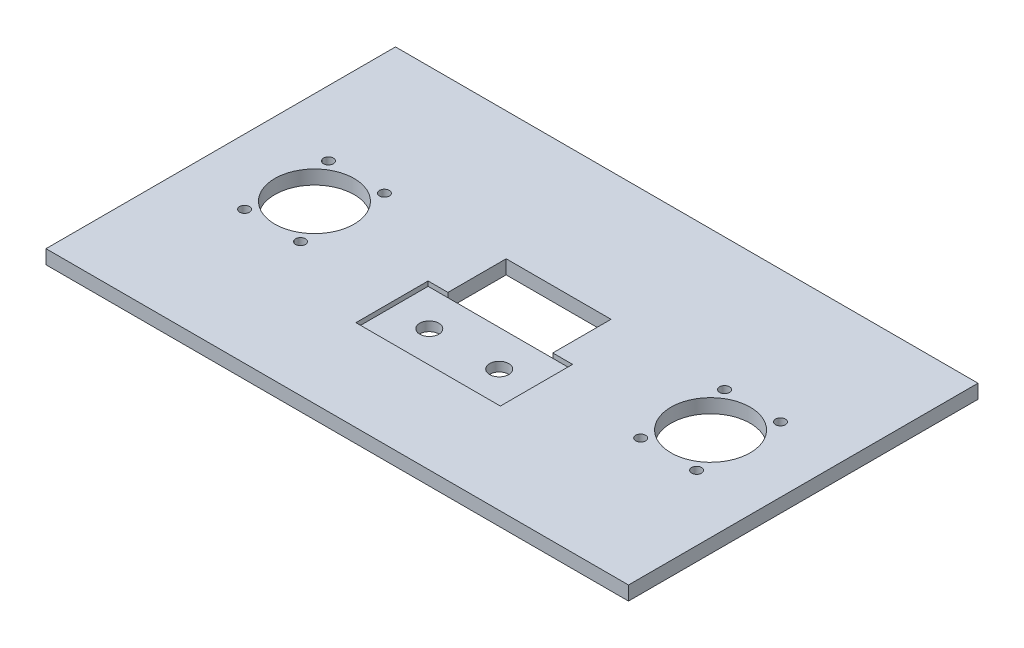
ISO-10303-21;
HEADER;
FILE_DESCRIPTION(('STEP AP214'),'2;1');
FILE_NAME('part.step','',(''),(''),'','','');
FILE_SCHEMA(('AUTOMOTIVE_DESIGN { 1 0 10303 214 1 1 1 1 }'));
ENDSEC;
DATA;
#1=APPLICATION_CONTEXT('core data for automotive mechanical design processes');
#2=APPLICATION_PROTOCOL_DEFINITION('international standard','automotive_design',2000,#1);
#3=PRODUCT_CONTEXT('',#1,'mechanical');
#4=PRODUCT('Part','Part','',(#3));
#5=PRODUCT_RELATED_PRODUCT_CATEGORY('part','',(#4));
#6=PRODUCT_DEFINITION_FORMATION('','',#4);
#7=PRODUCT_DEFINITION_CONTEXT('part definition',#1,'design');
#8=PRODUCT_DEFINITION('design','',#6,#7);
#9=PRODUCT_DEFINITION_SHAPE('','',#8);
#10=(LENGTH_UNIT() NAMED_UNIT(*) SI_UNIT(.MILLI.,.METRE.));
#11=(NAMED_UNIT(*) PLANE_ANGLE_UNIT() SI_UNIT($,.RADIAN.));
#12=(NAMED_UNIT(*) SI_UNIT($,.STERADIAN.) SOLID_ANGLE_UNIT());
#13=UNCERTAINTY_MEASURE_WITH_UNIT(LENGTH_MEASURE(1.E-05),#10,'distance_accuracy_value','');
#14=(GEOMETRIC_REPRESENTATION_CONTEXT(3) GLOBAL_UNCERTAINTY_ASSIGNED_CONTEXT((#13)) GLOBAL_UNIT_ASSIGNED_CONTEXT((#10,
#11,#12)) REPRESENTATION_CONTEXT('',''));
#15=CARTESIAN_POINT('',(0.,0.,0.));
#16=DIRECTION('',(0.,0.,1.));
#17=DIRECTION('',(1.,0.,0.));
#18=AXIS2_PLACEMENT_3D('',#15,#16,#17);
#19=CARTESIAN_POINT('',(0.,6.,0.));
#20=DIRECTION('',(0.,1.,0.));
#21=DIRECTION('',(0.,0.,1.));
#22=AXIS2_PLACEMENT_3D('',#19,#20,#21);
#23=PLANE('',#22);
#24=CARTESIAN_POINT('',(-97.,6.,17.7776119620314));
#25=DIRECTION('',(0.,-1.,0.));
#26=DIRECTION('',(0.,0.,-1.));
#27=AXIS2_PLACEMENT_3D('',#24,#25,#26);
#28=CIRCLE('',#27,2.125);
#29=CARTESIAN_POINT('',(-97.,6.,15.6526119620314));
#30=VERTEX_POINT('',#29);
#31=EDGE_CURVE('E725',#30,#30,#28,.T.);
#32=ORIENTED_EDGE('',*,*,#31,.T.);
#33=EDGE_LOOP('',(#32));
#34=FACE_BOUND('',#33,.T.);
#35=CARTESIAN_POINT('',(-85.,6.,-0.222388037968629));
#36=DIRECTION('',(0.,1.,0.));
#37=DIRECTION('',(0.,0.,1.));
#38=AXIS2_PLACEMENT_3D('',#35,#36,#37);
#39=CIRCLE('',#38,17.);
#40=CARTESIAN_POINT('',(-85.,6.,16.7776119620314));
#41=VERTEX_POINT('',#40);
#42=EDGE_CURVE('E205',#41,#41,#39,.T.);
#43=ORIENTED_EDGE('',*,*,#42,.F.);
#44=EDGE_LOOP('',(#43));
#45=FACE_BOUND('',#44,.T.);
#46=CARTESIAN_POINT('',(85.,6.,-0.222388037968653));
#47=DIRECTION('',(0.,1.,0.));
#48=DIRECTION('',(0.,0.,1.));
#49=AXIS2_PLACEMENT_3D('',#46,#47,#48);
#50=CIRCLE('',#49,17.);
#51=CARTESIAN_POINT('',(85.,6.,16.7776119620314));
#52=VERTEX_POINT('',#51);
#53=EDGE_CURVE('E741',#52,#52,#50,.T.);
#54=ORIENTED_EDGE('',*,*,#53,.F.);
#55=EDGE_LOOP('',(#54));
#56=FACE_BOUND('',#55,.T.);
#57=CARTESIAN_POINT('',(97.,6.,-18.2223880379686));
#58=DIRECTION('',(0.,-1.,0.));
#59=DIRECTION('',(0.,0.,-1.));
#60=AXIS2_PLACEMENT_3D('',#57,#58,#59);
#61=CIRCLE('',#60,2.125);
#62=CARTESIAN_POINT('',(97.,6.,-20.3473880379686));
#63=VERTEX_POINT('',#62);
#64=EDGE_CURVE('E715',#63,#63,#61,.T.);
#65=ORIENTED_EDGE('',*,*,#64,.T.);
#66=EDGE_LOOP('',(#65));
#67=FACE_BOUND('',#66,.T.);
#68=DIRECTION('',(0.,0.,-1.));
#69=VECTOR('',#68,1.);
#70=CARTESIAN_POINT('',(-125.,6.,0.));
#71=LINE('',#70,#69);
#72=CARTESIAN_POINT('',(-125.,6.,75.));
#73=VERTEX_POINT('',#72);
#74=CARTESIAN_POINT('',(-125.,6.,-75.));
#75=VERTEX_POINT('',#74);
#76=EDGE_CURVE('E293',#73,#75,#71,.T.);
#77=ORIENTED_EDGE('',*,*,#76,.F.);
#78=DIRECTION('',(1.,0.,0.));
#79=VECTOR('',#78,1.);
#80=CARTESIAN_POINT('',(0.,6.,75.));
#81=LINE('',#80,#79);
#82=CARTESIAN_POINT('',(125.,6.,75.));
#83=VERTEX_POINT('',#82);
#84=EDGE_CURVE('E297',#73,#83,#81,.T.);
#85=ORIENTED_EDGE('',*,*,#84,.T.);
#86=DIRECTION('',(0.,0.,-1.));
#87=VECTOR('',#86,1.);
#88=CARTESIAN_POINT('',(125.,6.,0.));
#89=LINE('',#88,#87);
#90=CARTESIAN_POINT('',(125.,6.,-75.));
#91=VERTEX_POINT('',#90);
#92=EDGE_CURVE('E301',#83,#91,#89,.T.);
#93=ORIENTED_EDGE('',*,*,#92,.T.);
#94=DIRECTION('',(1.,0.,0.));
#95=VECTOR('',#94,1.);
#96=CARTESIAN_POINT('',(0.,6.,-75.));
#97=LINE('',#96,#95);
#98=EDGE_CURVE('E304',#75,#91,#97,.T.);
#99=ORIENTED_EDGE('',*,*,#98,.F.);
#100=EDGE_LOOP('',(#77,#85,#93,#99));
#101=FACE_BOUND('',#100,.T.);
#102=DIRECTION('',(1.,0.,0.));
#103=VECTOR('',#102,1.);
#104=CARTESIAN_POINT('',(0.,6.,-20.));
#105=LINE('',#104,#103);
#106=CARTESIAN_POINT('',(-22.5,6.,-20.));
#107=VERTEX_POINT('',#106);
#108=CARTESIAN_POINT('',(22.5,6.,-20.));
#109=VERTEX_POINT('',#108);
#110=EDGE_CURVE('E188',#107,#109,#105,.T.);
#111=ORIENTED_EDGE('',*,*,#110,.T.);
#112=DIRECTION('',(0.,0.,1.));
#113=VECTOR('',#112,1.);
#114=CARTESIAN_POINT('',(22.5,6.,0.));
#115=LINE('',#114,#113);
#116=CARTESIAN_POINT('',(22.5,6.,4.99999999999999));
#117=VERTEX_POINT('',#116);
#118=EDGE_CURVE('E197',#109,#117,#115,.T.);
#119=ORIENTED_EDGE('',*,*,#118,.T.);
#120=DIRECTION('',(1.,0.,0.));
#121=VECTOR('',#120,1.);
#122=CARTESIAN_POINT('',(0.,6.,4.99999999999999));
#123=LINE('',#122,#121);
#124=CARTESIAN_POINT('',(31.,6.,4.99999999999999));
#125=VERTEX_POINT('',#124);
#126=EDGE_CURVE('E271',#117,#125,#123,.T.);
#127=ORIENTED_EDGE('',*,*,#126,.T.);
#128=DIRECTION('',(0.,0.,-1.));
#129=VECTOR('',#128,1.);
#130=CARTESIAN_POINT('',(31.,6.,0.));
#131=LINE('',#130,#129);
#132=CARTESIAN_POINT('',(31.,6.,36.));
#133=VERTEX_POINT('',#132);
#134=EDGE_CURVE('E267',#133,#125,#131,.T.);
#135=ORIENTED_EDGE('',*,*,#134,.F.);
#136=DIRECTION('',(1.,0.,0.));
#137=VECTOR('',#136,1.);
#138=CARTESIAN_POINT('',(0.,6.,36.));
#139=LINE('',#138,#137);
#140=CARTESIAN_POINT('',(-31.,6.,36.));
#141=VERTEX_POINT('',#140);
#142=EDGE_CURVE('E264',#141,#133,#139,.T.);
#143=ORIENTED_EDGE('',*,*,#142,.F.);
#144=DIRECTION('',(0.,0.,-1.));
#145=VECTOR('',#144,1.);
#146=CARTESIAN_POINT('',(-31.,6.,0.));
#147=LINE('',#146,#145);
#148=CARTESIAN_POINT('',(-31.,6.,4.99999999999999));
#149=VERTEX_POINT('',#148);
#150=EDGE_CURVE('E241',#141,#149,#147,.T.);
#151=ORIENTED_EDGE('',*,*,#150,.T.);
#152=CARTESIAN_POINT('',(-22.5,6.,4.99999999999999));
#153=VERTEX_POINT('',#152);
#154=EDGE_CURVE('E272',#149,#153,#123,.T.);
#155=ORIENTED_EDGE('',*,*,#154,.T.);
#156=DIRECTION('',(0.,0.,1.));
#157=VECTOR('',#156,1.);
#158=CARTESIAN_POINT('',(-22.5,6.,0.));
#159=LINE('',#158,#157);
#160=EDGE_CURVE('E194',#107,#153,#159,.T.);
#161=ORIENTED_EDGE('',*,*,#160,.F.);
#162=EDGE_LOOP('',(#111,#119,#127,#135,#143,#151,#155,#161));
#163=FACE_BOUND('',#162,.T.);
#164=CARTESIAN_POINT('',(97.,6.,17.7776119620314));
#165=DIRECTION('',(0.,1.,0.));
#166=DIRECTION('',(0.,0.,1.));
#167=AXIS2_PLACEMENT_3D('',#164,#165,#166);
#168=CIRCLE('',#167,2.125);
#169=CARTESIAN_POINT('',(97.,6.,19.9026119620314));
#170=VERTEX_POINT('',#169);
#171=EDGE_CURVE('E701',#170,#170,#168,.T.);
#172=ORIENTED_EDGE('',*,*,#171,.F.);
#173=EDGE_LOOP('',(#172));
#174=FACE_BOUND('',#173,.T.);
#175=CARTESIAN_POINT('',(-97.,6.,-18.2223880379686));
#176=DIRECTION('',(0.,1.,0.));
#177=DIRECTION('',(0.,0.,1.));
#178=AXIS2_PLACEMENT_3D('',#175,#176,#177);
#179=CIRCLE('',#178,2.125);
#180=CARTESIAN_POINT('',(-97.,6.,-16.0973880379686));
#181=VERTEX_POINT('',#180);
#182=EDGE_CURVE('E729',#181,#181,#179,.T.);
#183=ORIENTED_EDGE('',*,*,#182,.F.);
#184=EDGE_LOOP('',(#183));
#185=FACE_BOUND('',#184,.T.);
#186=CARTESIAN_POINT('',(-73.,6.,-18.2223880379686));
#187=DIRECTION('',(0.,-1.,0.));
#188=DIRECTION('',(0.,0.,-1.));
#189=AXIS2_PLACEMENT_3D('',#186,#187,#188);
#190=CIRCLE('',#189,2.125);
#191=CARTESIAN_POINT('',(-73.,6.,-20.3473880379686));
#192=VERTEX_POINT('',#191);
#193=EDGE_CURVE('E737',#192,#192,#190,.T.);
#194=ORIENTED_EDGE('',*,*,#193,.T.);
#195=EDGE_LOOP('',(#194));
#196=FACE_BOUND('',#195,.T.);
#197=CARTESIAN_POINT('',(-73.,6.,17.7776119620314));
#198=DIRECTION('',(0.,1.,0.));
#199=DIRECTION('',(0.,0.,1.));
#200=AXIS2_PLACEMENT_3D('',#197,#198,#199);
#201=CIRCLE('',#200,2.125);
#202=CARTESIAN_POINT('',(-73.,6.,19.9026119620314));
#203=VERTEX_POINT('',#202);
#204=EDGE_CURVE('E730',#203,#203,#201,.T.);
#205=ORIENTED_EDGE('',*,*,#204,.F.);
#206=EDGE_LOOP('',(#205));
#207=FACE_BOUND('',#206,.T.);
#208=CARTESIAN_POINT('',(73.,6.,-18.2223880379686));
#209=DIRECTION('',(0.,1.,0.));
#210=DIRECTION('',(0.,0.,1.));
#211=AXIS2_PLACEMENT_3D('',#208,#209,#210);
#212=CIRCLE('',#211,2.125);
#213=CARTESIAN_POINT('',(73.,6.,-16.0973880379686));
#214=VERTEX_POINT('',#213);
#215=EDGE_CURVE('E720',#214,#214,#212,.T.);
#216=ORIENTED_EDGE('',*,*,#215,.F.);
#217=EDGE_LOOP('',(#216));
#218=FACE_BOUND('',#217,.T.);
#219=CARTESIAN_POINT('',(73.,6.,17.7776119620314));
#220=DIRECTION('',(0.,-1.,0.));
#221=DIRECTION('',(0.,0.,-1.));
#222=AXIS2_PLACEMENT_3D('',#219,#220,#221);
#223=CIRCLE('',#222,2.125);
#224=CARTESIAN_POINT('',(73.,6.,15.6526119620314));
#225=VERTEX_POINT('',#224);
#226=EDGE_CURVE('E714',#225,#225,#223,.T.);
#227=ORIENTED_EDGE('',*,*,#226,.T.);
#228=EDGE_LOOP('',(#227));
#229=FACE_BOUND('',#228,.T.);
#230=ADVANCED_FACE('F89',(#34,#45,#56,#67,#101,#163,#174,#185,#196,#207,#218,#229),#23,.T.);
#231=CARTESIAN_POINT('',(0.,0.,0.));
#232=DIRECTION('',(0.,1.,0.));
#233=DIRECTION('',(0.,0.,1.));
#234=AXIS2_PLACEMENT_3D('',#231,#232,#233);
#235=PLANE('',#234);
#236=CARTESIAN_POINT('',(73.,0.,-18.2223880379686));
#237=DIRECTION('',(0.,1.,0.));
#238=DIRECTION('',(0.,0.,1.));
#239=AXIS2_PLACEMENT_3D('',#236,#237,#238);
#240=CIRCLE('',#239,2.125);
#241=CARTESIAN_POINT('',(73.,0.,-16.0973880379686));
#242=VERTEX_POINT('',#241);
#243=EDGE_CURVE('E371',#242,#242,#240,.T.);
#244=ORIENTED_EDGE('',*,*,#243,.T.);
#245=EDGE_LOOP('',(#244));
#246=FACE_BOUND('',#245,.T.);
#247=CARTESIAN_POINT('',(-73.,0.,17.7776119620314));
#248=DIRECTION('',(0.,1.,0.));
#249=DIRECTION('',(0.,0.,1.));
#250=AXIS2_PLACEMENT_3D('',#247,#248,#249);
#251=CIRCLE('',#250,2.125);
#252=CARTESIAN_POINT('',(-73.,0.,19.9026119620314));
#253=VERTEX_POINT('',#252);
#254=EDGE_CURVE('E368',#253,#253,#251,.T.);
#255=ORIENTED_EDGE('',*,*,#254,.T.);
#256=EDGE_LOOP('',(#255));
#257=FACE_BOUND('',#256,.T.);
#258=CARTESIAN_POINT('',(-85.,0.,-0.222388037968629));
#259=DIRECTION('',(0.,1.,0.));
#260=DIRECTION('',(0.,0.,1.));
#261=AXIS2_PLACEMENT_3D('',#258,#259,#260);
#262=CIRCLE('',#261,17.);
#263=CARTESIAN_POINT('',(-85.,0.,16.7776119620314));
#264=VERTEX_POINT('',#263);
#265=EDGE_CURVE('E360',#264,#264,#262,.T.);
#266=ORIENTED_EDGE('',*,*,#265,.T.);
#267=EDGE_LOOP('',(#266));
#268=FACE_BOUND('',#267,.T.);
#269=CARTESIAN_POINT('',(85.,0.,-0.222388037968653));
#270=DIRECTION('',(0.,1.,0.));
#271=DIRECTION('',(0.,0.,1.));
#272=AXIS2_PLACEMENT_3D('',#269,#270,#271);
#273=CIRCLE('',#272,17.);
#274=CARTESIAN_POINT('',(85.,0.,16.7776119620314));
#275=VERTEX_POINT('',#274);
#276=EDGE_CURVE('E356',#275,#275,#273,.T.);
#277=ORIENTED_EDGE('',*,*,#276,.T.);
#278=EDGE_LOOP('',(#277));
#279=FACE_BOUND('',#278,.T.);
#280=CARTESIAN_POINT('',(-97.,0.,-18.2223880379686));
#281=DIRECTION('',(0.,1.,0.));
#282=DIRECTION('',(0.,0.,1.));
#283=AXIS2_PLACEMENT_3D('',#280,#281,#282);
#284=CIRCLE('',#283,2.125);
#285=CARTESIAN_POINT('',(-97.,0.,-16.0973880379686));
#286=VERTEX_POINT('',#285);
#287=EDGE_CURVE('E348',#286,#286,#284,.T.);
#288=ORIENTED_EDGE('',*,*,#287,.T.);
#289=EDGE_LOOP('',(#288));
#290=FACE_BOUND('',#289,.T.);
#291=CARTESIAN_POINT('',(97.,0.,17.7776119620314));
#292=DIRECTION('',(0.,1.,0.));
#293=DIRECTION('',(0.,0.,1.));
#294=AXIS2_PLACEMENT_3D('',#291,#292,#293);
#295=CIRCLE('',#294,2.125);
#296=CARTESIAN_POINT('',(97.,0.,19.9026119620314));
#297=VERTEX_POINT('',#296);
#298=EDGE_CURVE('E344',#297,#297,#295,.T.);
#299=ORIENTED_EDGE('',*,*,#298,.T.);
#300=EDGE_LOOP('',(#299));
#301=FACE_BOUND('',#300,.T.);
#302=CARTESIAN_POINT('',(-15.,0.,20.5));
#303=DIRECTION('',(0.,1.,0.));
#304=DIRECTION('',(0.,0.,1.));
#305=AXIS2_PLACEMENT_3D('',#302,#303,#304);
#306=CIRCLE('',#305,4.1);
#307=CARTESIAN_POINT('',(-15.,0.,24.6));
#308=VERTEX_POINT('',#307);
#309=EDGE_CURVE('E298',#308,#308,#306,.T.);
#310=ORIENTED_EDGE('',*,*,#309,.T.);
#311=EDGE_LOOP('',(#310));
#312=FACE_BOUND('',#311,.T.);
#313=CARTESIAN_POINT('',(15.,0.,20.5));
#314=DIRECTION('',(0.,1.,0.));
#315=DIRECTION('',(0.,0.,1.));
#316=AXIS2_PLACEMENT_3D('',#313,#314,#315);
#317=CIRCLE('',#316,4.1);
#318=CARTESIAN_POINT('',(15.,0.,24.6));
#319=VERTEX_POINT('',#318);
#320=EDGE_CURVE('E323',#319,#319,#317,.T.);
#321=ORIENTED_EDGE('',*,*,#320,.T.);
#322=EDGE_LOOP('',(#321));
#323=FACE_BOUND('',#322,.T.);
#324=DIRECTION('',(0.,0.,-1.));
#325=VECTOR('',#324,1.);
#326=CARTESIAN_POINT('',(-125.,0.,0.));
#327=LINE('',#326,#325);
#328=CARTESIAN_POINT('',(-125.,0.,75.));
#329=VERTEX_POINT('',#328);
#330=CARTESIAN_POINT('',(-125.,0.,-75.));
#331=VERTEX_POINT('',#330);
#332=EDGE_CURVE('E281',#329,#331,#327,.T.);
#333=ORIENTED_EDGE('',*,*,#332,.T.);
#334=DIRECTION('',(1.,0.,0.));
#335=VECTOR('',#334,1.);
#336=CARTESIAN_POINT('',(0.,0.,-75.));
#337=LINE('',#336,#335);
#338=CARTESIAN_POINT('',(125.,0.,-75.));
#339=VERTEX_POINT('',#338);
#340=EDGE_CURVE('E319',#331,#339,#337,.T.);
#341=ORIENTED_EDGE('',*,*,#340,.T.);
#342=DIRECTION('',(0.,0.,-1.));
#343=VECTOR('',#342,1.);
#344=CARTESIAN_POINT('',(125.,0.,0.));
#345=LINE('',#344,#343);
#346=CARTESIAN_POINT('',(125.,0.,75.));
#347=VERTEX_POINT('',#346);
#348=EDGE_CURVE('E315',#347,#339,#345,.T.);
#349=ORIENTED_EDGE('',*,*,#348,.F.);
#350=DIRECTION('',(1.,0.,0.));
#351=VECTOR('',#350,1.);
#352=CARTESIAN_POINT('',(0.,0.,75.));
#353=LINE('',#352,#351);
#354=EDGE_CURVE('E312',#329,#347,#353,.T.);
#355=ORIENTED_EDGE('',*,*,#354,.F.);
#356=EDGE_LOOP('',(#333,#341,#349,#355));
#357=FACE_BOUND('',#356,.T.);
#358=DIRECTION('',(0.,0.,1.));
#359=VECTOR('',#358,1.);
#360=CARTESIAN_POINT('',(22.5,0.,0.));
#361=LINE('',#360,#359);
#362=CARTESIAN_POINT('',(22.5,0.,-20.));
#363=VERTEX_POINT('',#362);
#364=CARTESIAN_POINT('',(22.5,0.,4.99999999999999));
#365=VERTEX_POINT('',#364);
#366=EDGE_CURVE('E232',#363,#365,#361,.T.);
#367=ORIENTED_EDGE('',*,*,#366,.F.);
#368=DIRECTION('',(1.,0.,0.));
#369=VECTOR('',#368,1.);
#370=CARTESIAN_POINT('',(0.,0.,-20.));
#371=LINE('',#370,#369);
#372=CARTESIAN_POINT('',(-22.5,0.,-20.));
#373=VERTEX_POINT('',#372);
#374=EDGE_CURVE('E12',#373,#363,#371,.T.);
#375=ORIENTED_EDGE('',*,*,#374,.F.);
#376=DIRECTION('',(0.,0.,1.));
#377=VECTOR('',#376,1.);
#378=CARTESIAN_POINT('',(-22.5,0.,0.));
#379=LINE('',#378,#377);
#380=CARTESIAN_POINT('',(-22.5,0.,4.99999999999999));
#381=VERTEX_POINT('',#380);
#382=EDGE_CURVE('E228',#373,#381,#379,.T.);
#383=ORIENTED_EDGE('',*,*,#382,.T.);
#384=DIRECTION('',(1.,0.,0.));
#385=VECTOR('',#384,1.);
#386=CARTESIAN_POINT('',(0.,0.,4.99999999999999));
#387=LINE('',#386,#385);
#388=EDGE_CURVE('E224',#381,#365,#387,.T.);
#389=ORIENTED_EDGE('',*,*,#388,.T.);
#390=EDGE_LOOP('',(#367,#375,#383,#389));
#391=FACE_BOUND('',#390,.T.);
#392=CARTESIAN_POINT('',(97.,0.,-18.2223880379686));
#393=DIRECTION('',(0.,1.,0.));
#394=DIRECTION('',(0.,0.,1.));
#395=AXIS2_PLACEMENT_3D('',#392,#393,#394);
#396=CIRCLE('',#395,2.125);
#397=CARTESIAN_POINT('',(97.,0.,-16.0973880379686));
#398=VERTEX_POINT('',#397);
#399=EDGE_CURVE('E235',#398,#398,#396,.F.);
#400=ORIENTED_EDGE('',*,*,#399,.F.);
#401=EDGE_LOOP('',(#400));
#402=FACE_BOUND('',#401,.T.);
#403=CARTESIAN_POINT('',(-73.,0.,-18.2223880379686));
#404=DIRECTION('',(0.,1.,0.));
#405=DIRECTION('',(0.,0.,1.));
#406=AXIS2_PLACEMENT_3D('',#403,#404,#405);
#407=CIRCLE('',#406,2.125);
#408=CARTESIAN_POINT('',(-73.,0.,-16.0973880379686));
#409=VERTEX_POINT('',#408);
#410=EDGE_CURVE('E352',#409,#409,#407,.F.);
#411=ORIENTED_EDGE('',*,*,#410,.F.);
#412=EDGE_LOOP('',(#411));
#413=FACE_BOUND('',#412,.T.);
#414=CARTESIAN_POINT('',(-97.,0.,17.7776119620314));
#415=DIRECTION('',(0.,1.,0.));
#416=DIRECTION('',(0.,0.,1.));
#417=AXIS2_PLACEMENT_3D('',#414,#415,#416);
#418=CIRCLE('',#417,2.125);
#419=CARTESIAN_POINT('',(-97.,0.,19.9026119620314));
#420=VERTEX_POINT('',#419);
#421=EDGE_CURVE('E364',#420,#420,#418,.F.);
#422=ORIENTED_EDGE('',*,*,#421,.F.);
#423=EDGE_LOOP('',(#422));
#424=FACE_BOUND('',#423,.T.);
#425=CARTESIAN_POINT('',(73.,0.,17.7776119620314));
#426=DIRECTION('',(0.,1.,0.));
#427=DIRECTION('',(0.,0.,1.));
#428=AXIS2_PLACEMENT_3D('',#425,#426,#427);
#429=CIRCLE('',#428,2.125);
#430=CARTESIAN_POINT('',(73.,0.,19.9026119620314));
#431=VERTEX_POINT('',#430);
#432=EDGE_CURVE('E93',#431,#431,#429,.F.);
#433=ORIENTED_EDGE('',*,*,#432,.F.);
#434=EDGE_LOOP('',(#433));
#435=FACE_BOUND('',#434,.T.);
#436=ADVANCED_FACE('F382',(#246,#257,#268,#279,#290,#301,#312,#323,#357,#391,#402,#413,#424,
#435),#235,.F.);
#437=CARTESIAN_POINT('',(0.,4.,4.99999999999999));
#438=DIRECTION('',(0.,0.,1.));
#439=DIRECTION('',(1.,0.,0.));
#440=AXIS2_PLACEMENT_3D('',#437,#438,#439);
#441=PLANE('',#440);
#442=ORIENTED_EDGE('',*,*,#126,.F.);
#443=DIRECTION('',(0.,1.,0.));
#444=VECTOR('',#443,1.);
#445=CARTESIAN_POINT('',(22.5,-23.,4.99999999999999));
#446=LINE('',#445,#444);
#447=CARTESIAN_POINT('',(22.5,4.,4.99999999999999));
#448=VERTEX_POINT('',#447);
#449=EDGE_CURVE('E201',#448,#117,#446,.T.);
#450=ORIENTED_EDGE('',*,*,#449,.F.);
#451=DIRECTION('',(1.,0.,0.));
#452=VECTOR('',#451,1.);
#453=CARTESIAN_POINT('',(0.,4.,4.99999999999999));
#454=LINE('',#453,#452);
#455=CARTESIAN_POINT('',(31.,4.,4.99999999999999));
#456=VERTEX_POINT('',#455);
#457=EDGE_CURVE('E253',#448,#456,#454,.T.);
#458=ORIENTED_EDGE('',*,*,#457,.T.);
#459=DIRECTION('',(0.,1.,0.));
#460=VECTOR('',#459,1.);
#461=CARTESIAN_POINT('',(31.,4.,4.99999999999999));
#462=LINE('',#461,#460);
#463=EDGE_CURVE('E286',#456,#125,#462,.T.);
#464=ORIENTED_EDGE('',*,*,#463,.T.);
#465=EDGE_LOOP('',(#442,#450,#458,#464));
#466=FACE_BOUND('',#465,.T.);
#467=ADVANCED_FACE('F384',(#466),#441,.T.);
#468=CARTESIAN_POINT('',(15.,6.,20.5));
#469=DIRECTION('',(0.,-1.,0.));
#470=DIRECTION('',(0.,0.,-1.));
#471=AXIS2_PLACEMENT_3D('',#468,#469,#470);
#472=CYLINDRICAL_SURFACE('',#471,4.1);
#473=ORIENTED_EDGE('',*,*,#320,.F.);
#474=EDGE_LOOP('',(#473));
#475=FACE_BOUND('',#474,.T.);
#476=CARTESIAN_POINT('',(15.,4.,20.5));
#477=DIRECTION('',(0.,1.,0.));
#478=DIRECTION('',(0.,0.,1.));
#479=AXIS2_PLACEMENT_3D('',#476,#477,#478);
#480=CIRCLE('',#479,4.1);
#481=CARTESIAN_POINT('',(15.,4.,24.6));
#482=VERTEX_POINT('',#481);
#483=EDGE_CURVE('E236',#482,#482,#480,.F.);
#484=ORIENTED_EDGE('',*,*,#483,.F.);
#485=EDGE_LOOP('',(#484));
#486=FACE_BOUND('',#485,.T.);
#487=ADVANCED_FACE('F390',(#475,#486),#472,.F.);
#488=CARTESIAN_POINT('',(-15.,6.,20.5));
#489=DIRECTION('',(0.,-1.,0.));
#490=DIRECTION('',(0.,0.,-1.));
#491=AXIS2_PLACEMENT_3D('',#488,#489,#490);
#492=CYLINDRICAL_SURFACE('',#491,4.1);
#493=ORIENTED_EDGE('',*,*,#309,.F.);
#494=EDGE_LOOP('',(#493));
#495=FACE_BOUND('',#494,.T.);
#496=CARTESIAN_POINT('',(-15.,4.,20.5));
#497=DIRECTION('',(0.,1.,0.));
#498=DIRECTION('',(0.,0.,1.));
#499=AXIS2_PLACEMENT_3D('',#496,#497,#498);
#500=CIRCLE('',#499,4.1);
#501=CARTESIAN_POINT('',(-15.,4.,24.6));
#502=VERTEX_POINT('',#501);
#503=EDGE_CURVE('E240',#502,#502,#500,.F.);
#504=ORIENTED_EDGE('',*,*,#503,.F.);
#505=EDGE_LOOP('',(#504));
#506=FACE_BOUND('',#505,.T.);
#507=ADVANCED_FACE('F399',(#495,#506),#492,.F.);
#508=CARTESIAN_POINT('',(-125.,6.,0.));
#509=DIRECTION('',(-1.,0.,0.));
#510=DIRECTION('',(0.,0.,1.));
#511=AXIS2_PLACEMENT_3D('',#508,#509,#510);
#512=PLANE('',#511);
#513=ORIENTED_EDGE('',*,*,#332,.F.);
#514=DIRECTION('',(0.,-1.,0.));
#515=VECTOR('',#514,1.);
#516=CARTESIAN_POINT('',(-125.,6.,75.));
#517=LINE('',#516,#515);
#518=EDGE_CURVE('E99',#73,#329,#517,.T.);
#519=ORIENTED_EDGE('',*,*,#518,.F.);
#520=ORIENTED_EDGE('',*,*,#76,.T.);
#521=DIRECTION('',(0.,-1.,0.));
#522=VECTOR('',#521,1.);
#523=CARTESIAN_POINT('',(-125.,6.,-75.));
#524=LINE('',#523,#522);
#525=EDGE_CURVE('E308',#75,#331,#524,.T.);
#526=ORIENTED_EDGE('',*,*,#525,.T.);
#527=EDGE_LOOP('',(#513,#519,#520,#526));
#528=FACE_BOUND('',#527,.T.);
#529=ADVANCED_FACE('F91',(#528),#512,.T.);
#530=CARTESIAN_POINT('',(0.,6.,75.));
#531=DIRECTION('',(0.,0.,-1.));
#532=DIRECTION('',(-1.,0.,0.));
#533=AXIS2_PLACEMENT_3D('',#530,#531,#532);
#534=PLANE('',#533);
#535=ORIENTED_EDGE('',*,*,#354,.T.);
#536=DIRECTION('',(0.,-1.,0.));
#537=VECTOR('',#536,1.);
#538=CARTESIAN_POINT('',(125.,6.,75.));
#539=LINE('',#538,#537);
#540=EDGE_CURVE('E335',#83,#347,#539,.T.);
#541=ORIENTED_EDGE('',*,*,#540,.F.);
#542=ORIENTED_EDGE('',*,*,#84,.F.);
#543=ORIENTED_EDGE('',*,*,#518,.T.);
#544=EDGE_LOOP('',(#535,#541,#542,#543));
#545=FACE_BOUND('',#544,.T.);
#546=ADVANCED_FACE('F413',(#545),#534,.F.);
#547=CARTESIAN_POINT('',(125.,6.,0.));
#548=DIRECTION('',(-1.,0.,0.));
#549=DIRECTION('',(0.,0.,1.));
#550=AXIS2_PLACEMENT_3D('',#547,#548,#549);
#551=PLANE('',#550);
#552=ORIENTED_EDGE('',*,*,#348,.T.);
#553=DIRECTION('',(0.,-1.,0.));
#554=VECTOR('',#553,1.);
#555=CARTESIAN_POINT('',(125.,6.,-75.));
#556=LINE('',#555,#554);
#557=EDGE_CURVE('E332',#91,#339,#556,.T.);
#558=ORIENTED_EDGE('',*,*,#557,.F.);
#559=ORIENTED_EDGE('',*,*,#92,.F.);
#560=ORIENTED_EDGE('',*,*,#540,.T.);
#561=EDGE_LOOP('',(#552,#558,#559,#560));
#562=FACE_BOUND('',#561,.T.);
#563=ADVANCED_FACE('F410',(#562),#551,.F.);
#564=CARTESIAN_POINT('',(0.,6.,-75.));
#565=DIRECTION('',(0.,0.,-1.));
#566=DIRECTION('',(-1.,0.,0.));
#567=AXIS2_PLACEMENT_3D('',#564,#565,#566);
#568=PLANE('',#567);
#569=ORIENTED_EDGE('',*,*,#340,.F.);
#570=ORIENTED_EDGE('',*,*,#525,.F.);
#571=ORIENTED_EDGE('',*,*,#98,.T.);
#572=ORIENTED_EDGE('',*,*,#557,.T.);
#573=EDGE_LOOP('',(#569,#570,#571,#572));
#574=FACE_BOUND('',#573,.T.);
#575=ADVANCED_FACE('F406',(#574),#568,.T.);
#576=CARTESIAN_POINT('',(0.,4.,36.));
#577=DIRECTION('',(0.,0.,1.));
#578=DIRECTION('',(1.,0.,0.));
#579=AXIS2_PLACEMENT_3D('',#576,#577,#578);
#580=PLANE('',#579);
#581=ORIENTED_EDGE('',*,*,#142,.T.);
#582=DIRECTION('',(0.,1.,0.));
#583=VECTOR('',#582,1.);
#584=CARTESIAN_POINT('',(31.,4.,36.));
#585=LINE('',#584,#583);
#586=CARTESIAN_POINT('',(31.,4.,36.));
#587=VERTEX_POINT('',#586);
#588=EDGE_CURVE('E263',#587,#133,#585,.T.);
#589=ORIENTED_EDGE('',*,*,#588,.F.);
#590=DIRECTION('',(1.,0.,0.));
#591=VECTOR('',#590,1.);
#592=CARTESIAN_POINT('',(0.,4.,36.));
#593=LINE('',#592,#591);
#594=CARTESIAN_POINT('',(-31.,4.,36.));
#595=VERTEX_POINT('',#594);
#596=EDGE_CURVE('E245',#595,#587,#593,.T.);
#597=ORIENTED_EDGE('',*,*,#596,.F.);
#598=DIRECTION('',(0.,1.,0.));
#599=VECTOR('',#598,1.);
#600=CARTESIAN_POINT('',(-31.,4.,36.));
#601=LINE('',#600,#599);
#602=EDGE_CURVE('E278',#595,#141,#601,.T.);
#603=ORIENTED_EDGE('',*,*,#602,.T.);
#604=EDGE_LOOP('',(#581,#589,#597,#603));
#605=FACE_BOUND('',#604,.T.);
#606=ADVANCED_FACE('F409',(#605),#580,.F.);
#607=CARTESIAN_POINT('',(-31.,4.,0.));
#608=DIRECTION('',(1.,0.,0.));
#609=DIRECTION('',(0.,0.,-1.));
#610=AXIS2_PLACEMENT_3D('',#607,#608,#609);
#611=PLANE('',#610);
#612=ORIENTED_EDGE('',*,*,#150,.F.);
#613=ORIENTED_EDGE('',*,*,#602,.F.);
#614=DIRECTION('',(0.,0.,-1.));
#615=VECTOR('',#614,1.);
#616=CARTESIAN_POINT('',(-31.,4.,0.));
#617=LINE('',#616,#615);
#618=CARTESIAN_POINT('',(-31.,4.,4.99999999999999));
#619=VERTEX_POINT('',#618);
#620=EDGE_CURVE('E258',#595,#619,#617,.T.);
#621=ORIENTED_EDGE('',*,*,#620,.T.);
#622=DIRECTION('',(0.,1.,0.));
#623=VECTOR('',#622,1.);
#624=CARTESIAN_POINT('',(-31.,4.,4.99999999999999));
#625=LINE('',#624,#623);
#626=EDGE_CURVE('E282',#619,#149,#625,.T.);
#627=ORIENTED_EDGE('',*,*,#626,.T.);
#628=EDGE_LOOP('',(#612,#613,#621,#627));
#629=FACE_BOUND('',#628,.T.);
#630=ADVANCED_FACE('F496',(#629),#611,.T.);
#631=DIRECTION('',(0.,1.,0.));
#632=VECTOR('',#631,1.);
#633=CARTESIAN_POINT('',(-22.5,-23.,4.99999999999999));
#634=LINE('',#633,#632);
#635=CARTESIAN_POINT('',(-22.5,4.,4.99999999999999));
#636=VERTEX_POINT('',#635);
#637=EDGE_CURVE('E218',#636,#153,#634,.T.);
#638=ORIENTED_EDGE('',*,*,#637,.T.);
#639=ORIENTED_EDGE('',*,*,#154,.F.);
#640=ORIENTED_EDGE('',*,*,#626,.F.);
#641=EDGE_CURVE('E254',#619,#636,#454,.T.);
#642=ORIENTED_EDGE('',*,*,#641,.T.);
#643=EDGE_LOOP('',(#638,#639,#640,#642));
#644=FACE_BOUND('',#643,.T.);
#645=ADVANCED_FACE('F393',(#644),#441,.T.);
#646=CARTESIAN_POINT('',(31.,4.,0.));
#647=DIRECTION('',(1.,0.,0.));
#648=DIRECTION('',(0.,0.,-1.));
#649=AXIS2_PLACEMENT_3D('',#646,#647,#648);
#650=PLANE('',#649);
#651=ORIENTED_EDGE('',*,*,#134,.T.);
#652=ORIENTED_EDGE('',*,*,#463,.F.);
#653=DIRECTION('',(0.,0.,-1.));
#654=VECTOR('',#653,1.);
#655=CARTESIAN_POINT('',(31.,4.,0.));
#656=LINE('',#655,#654);
#657=EDGE_CURVE('E249',#587,#456,#656,.T.);
#658=ORIENTED_EDGE('',*,*,#657,.F.);
#659=ORIENTED_EDGE('',*,*,#588,.T.);
#660=EDGE_LOOP('',(#651,#652,#658,#659));
#661=FACE_BOUND('',#660,.T.);
#662=ADVANCED_FACE('F494',(#661),#650,.F.);
#663=CARTESIAN_POINT('',(0.,4.,0.));
#664=DIRECTION('',(0.,1.,0.));
#665=DIRECTION('',(0.,0.,1.));
#666=AXIS2_PLACEMENT_3D('',#663,#664,#665);
#667=PLANE('',#666);
#668=ORIENTED_EDGE('',*,*,#483,.T.);
#669=EDGE_LOOP('',(#668));
#670=FACE_BOUND('',#669,.T.);
#671=ORIENTED_EDGE('',*,*,#503,.T.);
#672=EDGE_LOOP('',(#671));
#673=FACE_BOUND('',#672,.T.);
#674=ORIENTED_EDGE('',*,*,#596,.T.);
#675=ORIENTED_EDGE('',*,*,#657,.T.);
#676=ORIENTED_EDGE('',*,*,#457,.F.);
#677=EDGE_CURVE('E259',#636,#448,#454,.T.);
#678=ORIENTED_EDGE('',*,*,#677,.F.);
#679=ORIENTED_EDGE('',*,*,#641,.F.);
#680=ORIENTED_EDGE('',*,*,#620,.F.);
#681=EDGE_LOOP('',(#674,#675,#676,#678,#679,#680));
#682=FACE_BOUND('',#681,.T.);
#683=ADVANCED_FACE('F489',(#670,#673,#682),#667,.T.);
#684=CARTESIAN_POINT('',(0.,-23.,-20.));
#685=DIRECTION('',(0.,0.,1.));
#686=DIRECTION('',(1.,0.,0.));
#687=AXIS2_PLACEMENT_3D('',#684,#685,#686);
#688=PLANE('',#687);
#689=ORIENTED_EDGE('',*,*,#374,.T.);
#690=DIRECTION('',(0.,1.,0.));
#691=VECTOR('',#690,1.);
#692=CARTESIAN_POINT('',(22.5,-23.,-20.));
#693=LINE('',#692,#691);
#694=EDGE_CURVE('E184',#363,#109,#693,.T.);
#695=ORIENTED_EDGE('',*,*,#694,.T.);
#696=ORIENTED_EDGE('',*,*,#110,.F.);
#697=DIRECTION('',(0.,1.,0.));
#698=VECTOR('',#697,1.);
#699=CARTESIAN_POINT('',(-22.5,-23.,-20.));
#700=LINE('',#699,#698);
#701=EDGE_CURVE('E106',#373,#107,#700,.T.);
#702=ORIENTED_EDGE('',*,*,#701,.F.);
#703=EDGE_LOOP('',(#689,#695,#696,#702));
#704=FACE_BOUND('',#703,.T.);
#705=ADVANCED_FACE('F186',(#704),#688,.T.);
#706=CARTESIAN_POINT('',(22.5,-23.,0.));
#707=DIRECTION('',(-1.,0.,0.));
#708=DIRECTION('',(0.,0.,1.));
#709=AXIS2_PLACEMENT_3D('',#706,#707,#708);
#710=PLANE('',#709);
#711=ORIENTED_EDGE('',*,*,#366,.T.);
#712=EDGE_CURVE('E217',#365,#448,#446,.T.);
#713=ORIENTED_EDGE('',*,*,#712,.T.);
#714=ORIENTED_EDGE('',*,*,#449,.T.);
#715=ORIENTED_EDGE('',*,*,#118,.F.);
#716=ORIENTED_EDGE('',*,*,#694,.F.);
#717=EDGE_LOOP('',(#711,#713,#714,#715,#716));
#718=FACE_BOUND('',#717,.T.);
#719=ADVANCED_FACE('F198',(#718),#710,.T.);
#720=CARTESIAN_POINT('',(-22.5,-23.,0.));
#721=DIRECTION('',(-1.,0.,0.));
#722=DIRECTION('',(0.,0.,1.));
#723=AXIS2_PLACEMENT_3D('',#720,#721,#722);
#724=PLANE('',#723);
#725=ORIENTED_EDGE('',*,*,#701,.T.);
#726=ORIENTED_EDGE('',*,*,#160,.T.);
#727=ORIENTED_EDGE('',*,*,#637,.F.);
#728=EDGE_CURVE('E114',#381,#636,#634,.T.);
#729=ORIENTED_EDGE('',*,*,#728,.F.);
#730=ORIENTED_EDGE('',*,*,#382,.F.);
#731=EDGE_LOOP('',(#725,#726,#727,#729,#730));
#732=FACE_BOUND('',#731,.T.);
#733=ADVANCED_FACE('F483',(#732),#724,.F.);
#734=CARTESIAN_POINT('',(0.,-23.,4.99999999999999));
#735=DIRECTION('',(0.,0.,1.));
#736=DIRECTION('',(1.,0.,0.));
#737=AXIS2_PLACEMENT_3D('',#734,#735,#736);
#738=PLANE('',#737);
#739=ORIENTED_EDGE('',*,*,#728,.T.);
#740=ORIENTED_EDGE('',*,*,#677,.T.);
#741=ORIENTED_EDGE('',*,*,#712,.F.);
#742=ORIENTED_EDGE('',*,*,#388,.F.);
#743=EDGE_LOOP('',(#739,#740,#741,#742));
#744=FACE_BOUND('',#743,.T.);
#745=ADVANCED_FACE('F480',(#744),#738,.F.);
#746=CARTESIAN_POINT('',(97.,-23.,-18.2223880379686));
#747=DIRECTION('',(0.,1.,0.));
#748=DIRECTION('',(0.,0.,1.));
#749=AXIS2_PLACEMENT_3D('',#746,#747,#748);
#750=CYLINDRICAL_SURFACE('',#749,2.125);
#751=ORIENTED_EDGE('',*,*,#64,.F.);
#752=EDGE_LOOP('',(#751));
#753=FACE_BOUND('',#752,.T.);
#754=ORIENTED_EDGE('',*,*,#399,.T.);
#755=EDGE_LOOP('',(#754));
#756=FACE_BOUND('',#755,.T.);
#757=ADVANCED_FACE('F459',(#753,#756),#750,.F.);
#758=CARTESIAN_POINT('',(97.,-23.,17.7776119620314));
#759=DIRECTION('',(0.,1.,0.));
#760=DIRECTION('',(0.,0.,1.));
#761=AXIS2_PLACEMENT_3D('',#758,#759,#760);
#762=CYLINDRICAL_SURFACE('',#761,2.125);
#763=ORIENTED_EDGE('',*,*,#171,.T.);
#764=EDGE_LOOP('',(#763));
#765=FACE_BOUND('',#764,.T.);
#766=ORIENTED_EDGE('',*,*,#298,.F.);
#767=EDGE_LOOP('',(#766));
#768=FACE_BOUND('',#767,.T.);
#769=ADVANCED_FACE('F474',(#765,#768),#762,.F.);
#770=CARTESIAN_POINT('',(-97.,-23.,-18.2223880379686));
#771=DIRECTION('',(0.,1.,0.));
#772=DIRECTION('',(0.,0.,1.));
#773=AXIS2_PLACEMENT_3D('',#770,#771,#772);
#774=CYLINDRICAL_SURFACE('',#773,2.125);
#775=ORIENTED_EDGE('',*,*,#182,.T.);
#776=EDGE_LOOP('',(#775));
#777=FACE_BOUND('',#776,.T.);
#778=ORIENTED_EDGE('',*,*,#287,.F.);
#779=EDGE_LOOP('',(#778));
#780=FACE_BOUND('',#779,.T.);
#781=ADVANCED_FACE('F471',(#777,#780),#774,.F.);
#782=CARTESIAN_POINT('',(-73.,-23.,-18.2223880379686));
#783=DIRECTION('',(0.,1.,0.));
#784=DIRECTION('',(0.,0.,1.));
#785=AXIS2_PLACEMENT_3D('',#782,#783,#784);
#786=CYLINDRICAL_SURFACE('',#785,2.125);
#787=ORIENTED_EDGE('',*,*,#193,.F.);
#788=EDGE_LOOP('',(#787));
#789=FACE_BOUND('',#788,.T.);
#790=ORIENTED_EDGE('',*,*,#410,.T.);
#791=EDGE_LOOP('',(#790));
#792=FACE_BOUND('',#791,.T.);
#793=ADVANCED_FACE('F468',(#789,#792),#786,.F.);
#794=CARTESIAN_POINT('',(85.,-23.,-0.222388037968653));
#795=DIRECTION('',(0.,1.,0.));
#796=DIRECTION('',(0.,0.,1.));
#797=AXIS2_PLACEMENT_3D('',#794,#795,#796);
#798=CYLINDRICAL_SURFACE('',#797,17.);
#799=ORIENTED_EDGE('',*,*,#53,.T.);
#800=EDGE_LOOP('',(#799));
#801=FACE_BOUND('',#800,.T.);
#802=ORIENTED_EDGE('',*,*,#276,.F.);
#803=EDGE_LOOP('',(#802));
#804=FACE_BOUND('',#803,.T.);
#805=ADVANCED_FACE('F454',(#801,#804),#798,.F.);
#806=CARTESIAN_POINT('',(-85.,-23.,-0.222388037968629));
#807=DIRECTION('',(0.,1.,0.));
#808=DIRECTION('',(0.,0.,1.));
#809=AXIS2_PLACEMENT_3D('',#806,#807,#808);
#810=CYLINDRICAL_SURFACE('',#809,17.);
#811=ORIENTED_EDGE('',*,*,#42,.T.);
#812=EDGE_LOOP('',(#811));
#813=FACE_BOUND('',#812,.T.);
#814=ORIENTED_EDGE('',*,*,#265,.F.);
#815=EDGE_LOOP('',(#814));
#816=FACE_BOUND('',#815,.T.);
#817=ADVANCED_FACE('F444',(#813,#816),#810,.F.);
#818=CARTESIAN_POINT('',(-97.,-23.,17.7776119620314));
#819=DIRECTION('',(0.,1.,0.));
#820=DIRECTION('',(0.,0.,1.));
#821=AXIS2_PLACEMENT_3D('',#818,#819,#820);
#822=CYLINDRICAL_SURFACE('',#821,2.125);
#823=ORIENTED_EDGE('',*,*,#31,.F.);
#824=EDGE_LOOP('',(#823));
#825=FACE_BOUND('',#824,.T.);
#826=ORIENTED_EDGE('',*,*,#421,.T.);
#827=EDGE_LOOP('',(#826));
#828=FACE_BOUND('',#827,.T.);
#829=ADVANCED_FACE('F441',(#825,#828),#822,.F.);
#830=CARTESIAN_POINT('',(-73.,-23.,17.7776119620314));
#831=DIRECTION('',(0.,1.,0.));
#832=DIRECTION('',(0.,0.,1.));
#833=AXIS2_PLACEMENT_3D('',#830,#831,#832);
#834=CYLINDRICAL_SURFACE('',#833,2.125);
#835=ORIENTED_EDGE('',*,*,#204,.T.);
#836=EDGE_LOOP('',(#835));
#837=FACE_BOUND('',#836,.T.);
#838=ORIENTED_EDGE('',*,*,#254,.F.);
#839=EDGE_LOOP('',(#838));
#840=FACE_BOUND('',#839,.T.);
#841=ADVANCED_FACE('F443',(#837,#840),#834,.F.);
#842=CARTESIAN_POINT('',(73.,-23.,-18.2223880379686));
#843=DIRECTION('',(0.,1.,0.));
#844=DIRECTION('',(0.,0.,1.));
#845=AXIS2_PLACEMENT_3D('',#842,#843,#844);
#846=CYLINDRICAL_SURFACE('',#845,2.125);
#847=ORIENTED_EDGE('',*,*,#215,.T.);
#848=EDGE_LOOP('',(#847));
#849=FACE_BOUND('',#848,.T.);
#850=ORIENTED_EDGE('',*,*,#243,.F.);
#851=EDGE_LOOP('',(#850));
#852=FACE_BOUND('',#851,.T.);
#853=ADVANCED_FACE('F451',(#849,#852),#846,.F.);
#854=CARTESIAN_POINT('',(73.,-23.,17.7776119620314));
#855=DIRECTION('',(0.,1.,0.));
#856=DIRECTION('',(0.,0.,1.));
#857=AXIS2_PLACEMENT_3D('',#854,#855,#856);
#858=CYLINDRICAL_SURFACE('',#857,2.125);
#859=ORIENTED_EDGE('',*,*,#226,.F.);
#860=EDGE_LOOP('',(#859));
#861=FACE_BOUND('',#860,.T.);
#862=ORIENTED_EDGE('',*,*,#432,.T.);
#863=EDGE_LOOP('',(#862));
#864=FACE_BOUND('',#863,.T.);
#865=ADVANCED_FACE('F380',(#861,#864),#858,.F.);
#866=CLOSED_SHELL('',(#230,#436,#467,#487,#507,#529,#546,#563,#575,#606,#630,#645,#662,#683,
#705,#719,#733,#745,#757,#769,#781,#793,#805,#817,#829,#841,#853,#865));
#867=MANIFOLD_SOLID_BREP('B2',#866);
#868=ADVANCED_BREP_SHAPE_REPRESENTATION('',(#18,#867),#14);
#869=SHAPE_DEFINITION_REPRESENTATION(#9,#868);
ENDSEC;
END-ISO-10303-21;
